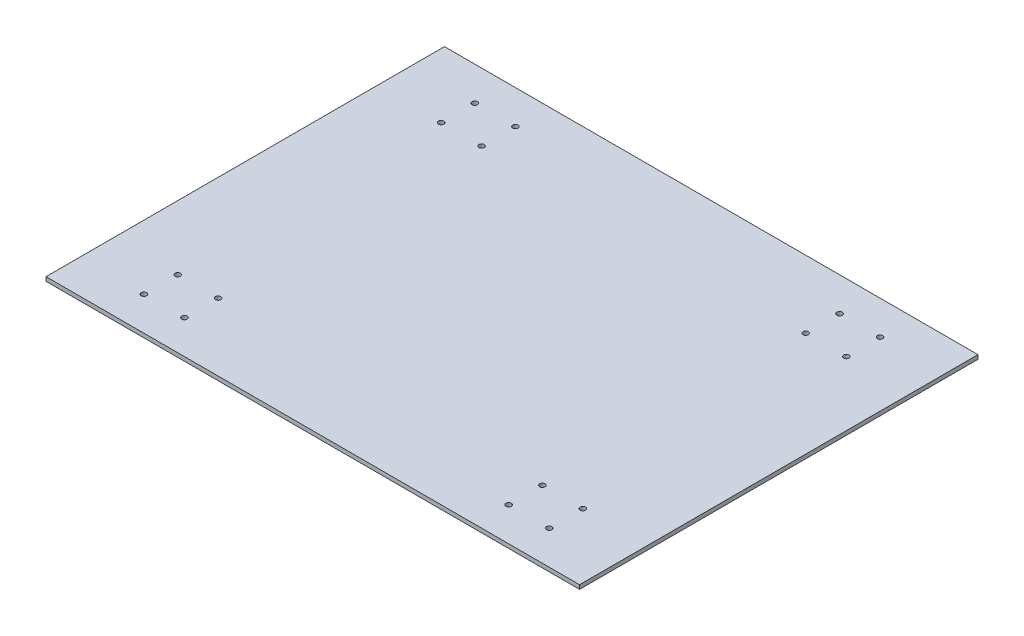
ISO-10303-21;
HEADER;
FILE_DESCRIPTION(('STEP AP214'),'2;1');
FILE_NAME('part.step','',(''),(''),'','','');
FILE_SCHEMA(('AUTOMOTIVE_DESIGN { 1 0 10303 214 1 1 1 1 }'));
ENDSEC;
DATA;
#1=APPLICATION_CONTEXT('core data for automotive mechanical design processes');
#2=APPLICATION_PROTOCOL_DEFINITION('international standard','automotive_design',2000,#1);
#3=PRODUCT_CONTEXT('',#1,'mechanical');
#4=PRODUCT('Part','Part','',(#3));
#5=PRODUCT_RELATED_PRODUCT_CATEGORY('part','',(#4));
#6=PRODUCT_DEFINITION_FORMATION('','',#4);
#7=PRODUCT_DEFINITION_CONTEXT('part definition',#1,'design');
#8=PRODUCT_DEFINITION('design','',#6,#7);
#9=PRODUCT_DEFINITION_SHAPE('','',#8);
#10=(LENGTH_UNIT() NAMED_UNIT(*) SI_UNIT(.MILLI.,.METRE.));
#11=(NAMED_UNIT(*) PLANE_ANGLE_UNIT() SI_UNIT($,.RADIAN.));
#12=(NAMED_UNIT(*) SI_UNIT($,.STERADIAN.) SOLID_ANGLE_UNIT());
#13=UNCERTAINTY_MEASURE_WITH_UNIT(LENGTH_MEASURE(1.E-05),#10,'distance_accuracy_value','');
#14=(GEOMETRIC_REPRESENTATION_CONTEXT(3) GLOBAL_UNCERTAINTY_ASSIGNED_CONTEXT((#13)) GLOBAL_UNIT_ASSIGNED_CONTEXT((#10,
#11,#12)) REPRESENTATION_CONTEXT('',''));
#15=CARTESIAN_POINT('',(0.,0.,0.));
#16=DIRECTION('',(0.,0.,1.));
#17=DIRECTION('',(1.,0.,0.));
#18=AXIS2_PLACEMENT_3D('',#15,#16,#17);
#19=CARTESIAN_POINT('',(197.5,3.,-147.5));
#20=DIRECTION('',(-1.,0.,0.));
#21=DIRECTION('',(0.,0.,1.));
#22=AXIS2_PLACEMENT_3D('',#19,#20,#21);
#23=PLANE('',#22);
#24=DIRECTION('',(0.,0.,-1.));
#25=VECTOR('',#24,1.);
#26=CARTESIAN_POINT('',(197.5,0.,-147.5));
#27=LINE('',#26,#25);
#28=CARTESIAN_POINT('',(197.5,0.,147.5));
#29=VERTEX_POINT('',#28);
#30=CARTESIAN_POINT('',(197.5,0.,-147.5));
#31=VERTEX_POINT('',#30);
#32=EDGE_CURVE('E97',#29,#31,#27,.T.);
#33=ORIENTED_EDGE('',*,*,#32,.T.);
#34=DIRECTION('',(0.,-1.,0.));
#35=VECTOR('',#34,1.);
#36=CARTESIAN_POINT('',(197.5,3.,-147.5));
#37=LINE('',#36,#35);
#38=CARTESIAN_POINT('',(197.5,3.,-147.5));
#39=VERTEX_POINT('',#38);
#40=EDGE_CURVE('E11',#39,#31,#37,.T.);
#41=ORIENTED_EDGE('',*,*,#40,.F.);
#42=DIRECTION('',(0.,0.,-1.));
#43=VECTOR('',#42,1.);
#44=CARTESIAN_POINT('',(197.5,3.,-147.5));
#45=LINE('',#44,#43);
#46=CARTESIAN_POINT('',(197.5,3.,147.5));
#47=VERTEX_POINT('',#46);
#48=EDGE_CURVE('E85',#47,#39,#45,.T.);
#49=ORIENTED_EDGE('',*,*,#48,.F.);
#50=DIRECTION('',(0.,-1.,0.));
#51=VECTOR('',#50,1.);
#52=CARTESIAN_POINT('',(197.5,3.,147.5));
#53=LINE('',#52,#51);
#54=EDGE_CURVE('E93',#47,#29,#53,.T.);
#55=ORIENTED_EDGE('',*,*,#54,.T.);
#56=EDGE_LOOP('',(#33,#41,#49,#55));
#57=FACE_BOUND('',#56,.T.);
#58=ADVANCED_FACE('F34',(#57),#23,.F.);
#59=CARTESIAN_POINT('',(-197.5,3.,-147.5));
#60=DIRECTION('',(0.,0.,1.));
#61=DIRECTION('',(1.,0.,0.));
#62=AXIS2_PLACEMENT_3D('',#59,#60,#61);
#63=PLANE('',#62);
#64=DIRECTION('',(-1.,0.,0.));
#65=VECTOR('',#64,1.);
#66=CARTESIAN_POINT('',(-197.5,0.,-147.5));
#67=LINE('',#66,#65);
#68=CARTESIAN_POINT('',(-197.5,0.,-147.5));
#69=VERTEX_POINT('',#68);
#70=EDGE_CURVE('E89',#31,#69,#67,.T.);
#71=ORIENTED_EDGE('',*,*,#70,.T.);
#72=DIRECTION('',(0.,-1.,0.));
#73=VECTOR('',#72,1.);
#74=CARTESIAN_POINT('',(-197.5,3.,-147.5));
#75=LINE('',#74,#73);
#76=CARTESIAN_POINT('',(-197.5,3.,-147.5));
#77=VERTEX_POINT('',#76);
#78=EDGE_CURVE('E42',#77,#69,#75,.T.);
#79=ORIENTED_EDGE('',*,*,#78,.F.);
#80=DIRECTION('',(-1.,0.,0.));
#81=VECTOR('',#80,1.);
#82=CARTESIAN_POINT('',(-197.5,3.,-147.5));
#83=LINE('',#82,#81);
#84=EDGE_CURVE('E80',#39,#77,#83,.T.);
#85=ORIENTED_EDGE('',*,*,#84,.F.);
#86=ORIENTED_EDGE('',*,*,#40,.T.);
#87=EDGE_LOOP('',(#71,#79,#85,#86));
#88=FACE_BOUND('',#87,.T.);
#89=ADVANCED_FACE('F88',(#88),#63,.F.);
#90=CARTESIAN_POINT('',(-197.5,3.,-147.5));
#91=DIRECTION('',(1.,0.,0.));
#92=DIRECTION('',(0.,0.,-1.));
#93=AXIS2_PLACEMENT_3D('',#90,#91,#92);
#94=PLANE('',#93);
#95=DIRECTION('',(0.,0.,1.));
#96=VECTOR('',#95,1.);
#97=CARTESIAN_POINT('',(-197.5,0.,-147.5));
#98=LINE('',#97,#96);
#99=CARTESIAN_POINT('',(-197.5,0.,147.5));
#100=VERTEX_POINT('',#99);
#101=EDGE_CURVE('E67',#69,#100,#98,.T.);
#102=ORIENTED_EDGE('',*,*,#101,.T.);
#103=DIRECTION('',(0.,-1.,0.));
#104=VECTOR('',#103,1.);
#105=CARTESIAN_POINT('',(-197.5,3.,147.5));
#106=LINE('',#105,#104);
#107=CARTESIAN_POINT('',(-197.5,3.,147.5));
#108=VERTEX_POINT('',#107);
#109=EDGE_CURVE('E90',#108,#100,#106,.T.);
#110=ORIENTED_EDGE('',*,*,#109,.F.);
#111=DIRECTION('',(0.,0.,1.));
#112=VECTOR('',#111,1.);
#113=CARTESIAN_POINT('',(-197.5,3.,-147.5));
#114=LINE('',#113,#112);
#115=EDGE_CURVE('E83',#77,#108,#114,.T.);
#116=ORIENTED_EDGE('',*,*,#115,.F.);
#117=ORIENTED_EDGE('',*,*,#78,.T.);
#118=EDGE_LOOP('',(#102,#110,#116,#117));
#119=FACE_BOUND('',#118,.T.);
#120=ADVANCED_FACE('F91',(#119),#94,.F.);
#121=CARTESIAN_POINT('',(-197.5,3.,147.5));
#122=DIRECTION('',(0.,0.,-1.));
#123=DIRECTION('',(-1.,0.,0.));
#124=AXIS2_PLACEMENT_3D('',#121,#122,#123);
#125=PLANE('',#124);
#126=DIRECTION('',(1.,0.,0.));
#127=VECTOR('',#126,1.);
#128=CARTESIAN_POINT('',(-197.5,0.,147.5));
#129=LINE('',#128,#127);
#130=EDGE_CURVE('E73',#100,#29,#129,.T.);
#131=ORIENTED_EDGE('',*,*,#130,.T.);
#132=ORIENTED_EDGE('',*,*,#54,.F.);
#133=DIRECTION('',(1.,0.,0.));
#134=VECTOR('',#133,1.);
#135=CARTESIAN_POINT('',(-197.5,3.,147.5));
#136=LINE('',#135,#134);
#137=EDGE_CURVE('E50',#108,#47,#136,.T.);
#138=ORIENTED_EDGE('',*,*,#137,.F.);
#139=ORIENTED_EDGE('',*,*,#109,.T.);
#140=EDGE_LOOP('',(#131,#132,#138,#139));
#141=FACE_BOUND('',#140,.T.);
#142=ADVANCED_FACE('F105',(#141),#125,.F.);
#143=CARTESIAN_POINT('',(0.,3.,0.));
#144=DIRECTION('',(0.,1.,0.));
#145=DIRECTION('',(0.,0.,1.));
#146=AXIS2_PLACEMENT_3D('',#143,#144,#145);
#147=PLANE('',#146);
#148=CARTESIAN_POINT('',(120.,3.,-97.5));
#149=DIRECTION('',(0.,1.,0.));
#150=DIRECTION('',(0.,0.,1.));
#151=AXIS2_PLACEMENT_3D('',#148,#149,#150);
#152=CIRCLE('',#151,2.);
#153=CARTESIAN_POINT('',(120.,3.,-95.5));
#154=VERTEX_POINT('',#153);
#155=EDGE_CURVE('E148',#154,#154,#152,.T.);
#156=ORIENTED_EDGE('',*,*,#155,.F.);
#157=EDGE_LOOP('',(#156));
#158=FACE_BOUND('',#157,.T.);
#159=CARTESIAN_POINT('',(150.,3.,-122.5));
#160=DIRECTION('',(0.,1.,0.));
#161=DIRECTION('',(0.,0.,1.));
#162=AXIS2_PLACEMENT_3D('',#159,#160,#161);
#163=CIRCLE('',#162,2.);
#164=CARTESIAN_POINT('',(150.,3.,-120.5));
#165=VERTEX_POINT('',#164);
#166=EDGE_CURVE('E141',#165,#165,#163,.T.);
#167=ORIENTED_EDGE('',*,*,#166,.F.);
#168=EDGE_LOOP('',(#167));
#169=FACE_BOUND('',#168,.T.);
#170=CARTESIAN_POINT('',(120.,3.,-122.5));
#171=DIRECTION('',(0.,1.,0.));
#172=DIRECTION('',(0.,0.,1.));
#173=AXIS2_PLACEMENT_3D('',#170,#171,#172);
#174=CIRCLE('',#173,1.99999999999998);
#175=CARTESIAN_POINT('',(120.,3.,-120.5));
#176=VERTEX_POINT('',#175);
#177=EDGE_CURVE('E160',#176,#176,#174,.T.);
#178=ORIENTED_EDGE('',*,*,#177,.F.);
#179=EDGE_LOOP('',(#178));
#180=FACE_BOUND('',#179,.T.);
#181=CARTESIAN_POINT('',(-120.,3.,122.5));
#182=DIRECTION('',(0.,1.,0.));
#183=DIRECTION('',(0.,0.,1.));
#184=AXIS2_PLACEMENT_3D('',#181,#182,#183);
#185=CIRCLE('',#184,2.);
#186=CARTESIAN_POINT('',(-120.,3.,124.5));
#187=VERTEX_POINT('',#186);
#188=EDGE_CURVE('E153',#187,#187,#185,.T.);
#189=ORIENTED_EDGE('',*,*,#188,.F.);
#190=EDGE_LOOP('',(#189));
#191=FACE_BOUND('',#190,.T.);
#192=CARTESIAN_POINT('',(120.,3.,122.5));
#193=DIRECTION('',(0.,1.,0.));
#194=DIRECTION('',(0.,0.,1.));
#195=AXIS2_PLACEMENT_3D('',#192,#193,#194);
#196=CIRCLE('',#195,2.);
#197=CARTESIAN_POINT('',(120.,3.,124.5));
#198=VERTEX_POINT('',#197);
#199=EDGE_CURVE('E124',#198,#198,#196,.T.);
#200=ORIENTED_EDGE('',*,*,#199,.F.);
#201=EDGE_LOOP('',(#200));
#202=FACE_BOUND('',#201,.T.);
#203=CARTESIAN_POINT('',(150.,3.,97.5));
#204=DIRECTION('',(0.,1.,0.));
#205=DIRECTION('',(0.,0.,1.));
#206=AXIS2_PLACEMENT_3D('',#203,#204,#205);
#207=CIRCLE('',#206,2.);
#208=CARTESIAN_POINT('',(150.,3.,99.5));
#209=VERTEX_POINT('',#208);
#210=EDGE_CURVE('E117',#209,#209,#207,.T.);
#211=ORIENTED_EDGE('',*,*,#210,.F.);
#212=EDGE_LOOP('',(#211));
#213=FACE_BOUND('',#212,.T.);
#214=CARTESIAN_POINT('',(120.,3.,97.5));
#215=DIRECTION('',(0.,1.,0.));
#216=DIRECTION('',(0.,0.,1.));
#217=AXIS2_PLACEMENT_3D('',#214,#215,#216);
#218=CIRCLE('',#217,2.);
#219=CARTESIAN_POINT('',(120.,3.,99.5));
#220=VERTEX_POINT('',#219);
#221=EDGE_CURVE('E136',#220,#220,#218,.T.);
#222=ORIENTED_EDGE('',*,*,#221,.F.);
#223=EDGE_LOOP('',(#222));
#224=FACE_BOUND('',#223,.T.);
#225=CARTESIAN_POINT('',(150.,3.,-97.5));
#226=DIRECTION('',(0.,1.,0.));
#227=DIRECTION('',(0.,0.,1.));
#228=AXIS2_PLACEMENT_3D('',#225,#226,#227);
#229=CIRCLE('',#228,2.);
#230=CARTESIAN_POINT('',(150.,3.,-95.5));
#231=VERTEX_POINT('',#230);
#232=EDGE_CURVE('E129',#231,#231,#229,.T.);
#233=ORIENTED_EDGE('',*,*,#232,.F.);
#234=EDGE_LOOP('',(#233));
#235=FACE_BOUND('',#234,.T.);
#236=CARTESIAN_POINT('',(-150.,3.,-97.5));
#237=DIRECTION('',(0.,1.,0.));
#238=DIRECTION('',(0.,0.,1.));
#239=AXIS2_PLACEMENT_3D('',#236,#237,#238);
#240=CIRCLE('',#239,2.);
#241=CARTESIAN_POINT('',(-150.,3.,-95.5));
#242=VERTEX_POINT('',#241);
#243=EDGE_CURVE('E196',#242,#242,#240,.T.);
#244=ORIENTED_EDGE('',*,*,#243,.F.);
#245=EDGE_LOOP('',(#244));
#246=FACE_BOUND('',#245,.T.);
#247=CARTESIAN_POINT('',(-120.,3.,-122.5));
#248=DIRECTION('',(0.,1.,0.));
#249=DIRECTION('',(0.,0.,1.));
#250=AXIS2_PLACEMENT_3D('',#247,#248,#249);
#251=CIRCLE('',#250,2.);
#252=CARTESIAN_POINT('',(-120.,3.,-120.5));
#253=VERTEX_POINT('',#252);
#254=EDGE_CURVE('E189',#253,#253,#251,.T.);
#255=ORIENTED_EDGE('',*,*,#254,.F.);
#256=EDGE_LOOP('',(#255));
#257=FACE_BOUND('',#256,.T.);
#258=CARTESIAN_POINT('',(-150.,3.,-122.5));
#259=DIRECTION('',(0.,1.,0.));
#260=DIRECTION('',(0.,0.,1.));
#261=AXIS2_PLACEMENT_3D('',#258,#259,#260);
#262=CIRCLE('',#261,2.);
#263=CARTESIAN_POINT('',(-150.,3.,-120.5));
#264=VERTEX_POINT('',#263);
#265=EDGE_CURVE('E201',#264,#264,#262,.T.);
#266=ORIENTED_EDGE('',*,*,#265,.F.);
#267=EDGE_LOOP('',(#266));
#268=FACE_BOUND('',#267,.T.);
#269=CARTESIAN_POINT('',(-150.,3.,122.5));
#270=DIRECTION('',(0.,1.,0.));
#271=DIRECTION('',(0.,0.,1.));
#272=AXIS2_PLACEMENT_3D('',#269,#270,#271);
#273=CIRCLE('',#272,2.);
#274=CARTESIAN_POINT('',(-150.,3.,124.5));
#275=VERTEX_POINT('',#274);
#276=EDGE_CURVE('E172',#275,#275,#273,.T.);
#277=ORIENTED_EDGE('',*,*,#276,.F.);
#278=EDGE_LOOP('',(#277));
#279=FACE_BOUND('',#278,.T.);
#280=CARTESIAN_POINT('',(-120.,3.,97.5));
#281=DIRECTION('',(0.,1.,0.));
#282=DIRECTION('',(0.,0.,1.));
#283=AXIS2_PLACEMENT_3D('',#280,#281,#282);
#284=CIRCLE('',#283,2.);
#285=CARTESIAN_POINT('',(-120.,3.,99.5));
#286=VERTEX_POINT('',#285);
#287=EDGE_CURVE('E165',#286,#286,#284,.T.);
#288=ORIENTED_EDGE('',*,*,#287,.F.);
#289=EDGE_LOOP('',(#288));
#290=FACE_BOUND('',#289,.T.);
#291=CARTESIAN_POINT('',(-150.,3.,97.5));
#292=DIRECTION('',(0.,1.,0.));
#293=DIRECTION('',(0.,0.,1.));
#294=AXIS2_PLACEMENT_3D('',#291,#292,#293);
#295=CIRCLE('',#294,2.);
#296=CARTESIAN_POINT('',(-150.,3.,99.5));
#297=VERTEX_POINT('',#296);
#298=EDGE_CURVE('E184',#297,#297,#295,.T.);
#299=ORIENTED_EDGE('',*,*,#298,.F.);
#300=EDGE_LOOP('',(#299));
#301=FACE_BOUND('',#300,.T.);
#302=CARTESIAN_POINT('',(-120.,3.,-97.5));
#303=DIRECTION('',(0.,1.,0.));
#304=DIRECTION('',(0.,0.,1.));
#305=AXIS2_PLACEMENT_3D('',#302,#303,#304);
#306=CIRCLE('',#305,2.);
#307=CARTESIAN_POINT('',(-120.,3.,-95.5));
#308=VERTEX_POINT('',#307);
#309=EDGE_CURVE('E177',#308,#308,#306,.T.);
#310=ORIENTED_EDGE('',*,*,#309,.F.);
#311=EDGE_LOOP('',(#310));
#312=FACE_BOUND('',#311,.T.);
#313=CARTESIAN_POINT('',(150.,3.,122.5));
#314=DIRECTION('',(0.,1.,0.));
#315=DIRECTION('',(0.,0.,1.));
#316=AXIS2_PLACEMENT_3D('',#313,#314,#315);
#317=CIRCLE('',#316,2.);
#318=CARTESIAN_POINT('',(150.,3.,124.5));
#319=VERTEX_POINT('',#318);
#320=EDGE_CURVE('E111',#319,#319,#317,.T.);
#321=ORIENTED_EDGE('',*,*,#320,.F.);
#322=EDGE_LOOP('',(#321));
#323=FACE_BOUND('',#322,.T.);
#324=ORIENTED_EDGE('',*,*,#48,.T.);
#325=ORIENTED_EDGE('',*,*,#84,.T.);
#326=ORIENTED_EDGE('',*,*,#115,.T.);
#327=ORIENTED_EDGE('',*,*,#137,.T.);
#328=EDGE_LOOP('',(#324,#325,#326,#327));
#329=FACE_BOUND('',#328,.T.);
#330=ADVANCED_FACE('F81',(#158,#169,#180,#191,#202,#213,#224,#235,#246,#257,#268,#279,#290,#301,
#312,#323,#329),#147,.T.);
#331=CARTESIAN_POINT('',(0.,0.,0.));
#332=DIRECTION('',(0.,1.,0.));
#333=DIRECTION('',(0.,0.,1.));
#334=AXIS2_PLACEMENT_3D('',#331,#332,#333);
#335=PLANE('',#334);
#336=CARTESIAN_POINT('',(120.,0.,-97.5));
#337=DIRECTION('',(0.,1.,0.));
#338=DIRECTION('',(0.,0.,1.));
#339=AXIS2_PLACEMENT_3D('',#336,#337,#338);
#340=CIRCLE('',#339,2.);
#341=CARTESIAN_POINT('',(120.,0.,-95.5));
#342=VERTEX_POINT('',#341);
#343=EDGE_CURVE('E133',#342,#342,#340,.T.);
#344=ORIENTED_EDGE('',*,*,#343,.T.);
#345=EDGE_LOOP('',(#344));
#346=FACE_BOUND('',#345,.T.);
#347=CARTESIAN_POINT('',(150.,0.,-122.5));
#348=DIRECTION('',(0.,1.,0.));
#349=DIRECTION('',(0.,0.,1.));
#350=AXIS2_PLACEMENT_3D('',#347,#348,#349);
#351=CIRCLE('',#350,2.);
#352=CARTESIAN_POINT('',(150.,0.,-120.5));
#353=VERTEX_POINT('',#352);
#354=EDGE_CURVE('E144',#353,#353,#351,.T.);
#355=ORIENTED_EDGE('',*,*,#354,.T.);
#356=EDGE_LOOP('',(#355));
#357=FACE_BOUND('',#356,.T.);
#358=CARTESIAN_POINT('',(120.,0.,-122.5));
#359=DIRECTION('',(0.,1.,0.));
#360=DIRECTION('',(0.,0.,1.));
#361=AXIS2_PLACEMENT_3D('',#358,#359,#360);
#362=CIRCLE('',#361,1.99999999999998);
#363=CARTESIAN_POINT('',(120.,0.,-120.5));
#364=VERTEX_POINT('',#363);
#365=EDGE_CURVE('E145',#364,#364,#362,.T.);
#366=ORIENTED_EDGE('',*,*,#365,.T.);
#367=EDGE_LOOP('',(#366));
#368=FACE_BOUND('',#367,.T.);
#369=CARTESIAN_POINT('',(-120.,0.,122.5));
#370=DIRECTION('',(0.,1.,0.));
#371=DIRECTION('',(0.,0.,1.));
#372=AXIS2_PLACEMENT_3D('',#369,#370,#371);
#373=CIRCLE('',#372,2.);
#374=CARTESIAN_POINT('',(-120.,0.,124.5));
#375=VERTEX_POINT('',#374);
#376=EDGE_CURVE('E156',#375,#375,#373,.T.);
#377=ORIENTED_EDGE('',*,*,#376,.T.);
#378=EDGE_LOOP('',(#377));
#379=FACE_BOUND('',#378,.T.);
#380=CARTESIAN_POINT('',(120.,0.,122.5));
#381=DIRECTION('',(0.,1.,0.));
#382=DIRECTION('',(0.,0.,1.));
#383=AXIS2_PLACEMENT_3D('',#380,#381,#382);
#384=CIRCLE('',#383,2.);
#385=CARTESIAN_POINT('',(120.,0.,124.5));
#386=VERTEX_POINT('',#385);
#387=EDGE_CURVE('E114',#386,#386,#384,.T.);
#388=ORIENTED_EDGE('',*,*,#387,.T.);
#389=EDGE_LOOP('',(#388));
#390=FACE_BOUND('',#389,.T.);
#391=CARTESIAN_POINT('',(150.,0.,97.5));
#392=DIRECTION('',(0.,1.,0.));
#393=DIRECTION('',(0.,0.,1.));
#394=AXIS2_PLACEMENT_3D('',#391,#392,#393);
#395=CIRCLE('',#394,2.);
#396=CARTESIAN_POINT('',(150.,0.,99.5));
#397=VERTEX_POINT('',#396);
#398=EDGE_CURVE('E120',#397,#397,#395,.T.);
#399=ORIENTED_EDGE('',*,*,#398,.T.);
#400=EDGE_LOOP('',(#399));
#401=FACE_BOUND('',#400,.T.);
#402=CARTESIAN_POINT('',(120.,0.,97.5));
#403=DIRECTION('',(0.,1.,0.));
#404=DIRECTION('',(0.,0.,1.));
#405=AXIS2_PLACEMENT_3D('',#402,#403,#404);
#406=CIRCLE('',#405,2.);
#407=CARTESIAN_POINT('',(120.,0.,99.5));
#408=VERTEX_POINT('',#407);
#409=EDGE_CURVE('E121',#408,#408,#406,.T.);
#410=ORIENTED_EDGE('',*,*,#409,.T.);
#411=EDGE_LOOP('',(#410));
#412=FACE_BOUND('',#411,.T.);
#413=CARTESIAN_POINT('',(150.,0.,-97.5));
#414=DIRECTION('',(0.,1.,0.));
#415=DIRECTION('',(0.,0.,1.));
#416=AXIS2_PLACEMENT_3D('',#413,#414,#415);
#417=CIRCLE('',#416,2.);
#418=CARTESIAN_POINT('',(150.,0.,-95.5));
#419=VERTEX_POINT('',#418);
#420=EDGE_CURVE('E132',#419,#419,#417,.T.);
#421=ORIENTED_EDGE('',*,*,#420,.T.);
#422=EDGE_LOOP('',(#421));
#423=FACE_BOUND('',#422,.T.);
#424=CARTESIAN_POINT('',(-150.,0.,-97.5));
#425=DIRECTION('',(0.,1.,0.));
#426=DIRECTION('',(0.,0.,1.));
#427=AXIS2_PLACEMENT_3D('',#424,#425,#426);
#428=CIRCLE('',#427,2.);
#429=CARTESIAN_POINT('',(-150.,0.,-95.5));
#430=VERTEX_POINT('',#429);
#431=EDGE_CURVE('E181',#430,#430,#428,.T.);
#432=ORIENTED_EDGE('',*,*,#431,.T.);
#433=EDGE_LOOP('',(#432));
#434=FACE_BOUND('',#433,.T.);
#435=CARTESIAN_POINT('',(-120.,0.,-122.5));
#436=DIRECTION('',(0.,1.,0.));
#437=DIRECTION('',(0.,0.,1.));
#438=AXIS2_PLACEMENT_3D('',#435,#436,#437);
#439=CIRCLE('',#438,2.);
#440=CARTESIAN_POINT('',(-120.,0.,-120.5));
#441=VERTEX_POINT('',#440);
#442=EDGE_CURVE('E192',#441,#441,#439,.T.);
#443=ORIENTED_EDGE('',*,*,#442,.T.);
#444=EDGE_LOOP('',(#443));
#445=FACE_BOUND('',#444,.T.);
#446=CARTESIAN_POINT('',(-150.,0.,-122.5));
#447=DIRECTION('',(0.,1.,0.));
#448=DIRECTION('',(0.,0.,1.));
#449=AXIS2_PLACEMENT_3D('',#446,#447,#448);
#450=CIRCLE('',#449,2.);
#451=CARTESIAN_POINT('',(-150.,0.,-120.5));
#452=VERTEX_POINT('',#451);
#453=EDGE_CURVE('E193',#452,#452,#450,.T.);
#454=ORIENTED_EDGE('',*,*,#453,.T.);
#455=EDGE_LOOP('',(#454));
#456=FACE_BOUND('',#455,.T.);
#457=CARTESIAN_POINT('',(-150.,0.,122.5));
#458=DIRECTION('',(0.,1.,0.));
#459=DIRECTION('',(0.,0.,1.));
#460=AXIS2_PLACEMENT_3D('',#457,#458,#459);
#461=CIRCLE('',#460,2.);
#462=CARTESIAN_POINT('',(-150.,0.,124.5));
#463=VERTEX_POINT('',#462);
#464=EDGE_CURVE('E157',#463,#463,#461,.T.);
#465=ORIENTED_EDGE('',*,*,#464,.T.);
#466=EDGE_LOOP('',(#465));
#467=FACE_BOUND('',#466,.T.);
#468=CARTESIAN_POINT('',(-120.,0.,97.5));
#469=DIRECTION('',(0.,1.,0.));
#470=DIRECTION('',(0.,0.,1.));
#471=AXIS2_PLACEMENT_3D('',#468,#469,#470);
#472=CIRCLE('',#471,2.);
#473=CARTESIAN_POINT('',(-120.,0.,99.5));
#474=VERTEX_POINT('',#473);
#475=EDGE_CURVE('E168',#474,#474,#472,.T.);
#476=ORIENTED_EDGE('',*,*,#475,.T.);
#477=EDGE_LOOP('',(#476));
#478=FACE_BOUND('',#477,.T.);
#479=CARTESIAN_POINT('',(-150.,0.,97.5));
#480=DIRECTION('',(0.,1.,0.));
#481=DIRECTION('',(0.,0.,1.));
#482=AXIS2_PLACEMENT_3D('',#479,#480,#481);
#483=CIRCLE('',#482,2.);
#484=CARTESIAN_POINT('',(-150.,0.,99.5));
#485=VERTEX_POINT('',#484);
#486=EDGE_CURVE('E169',#485,#485,#483,.T.);
#487=ORIENTED_EDGE('',*,*,#486,.T.);
#488=EDGE_LOOP('',(#487));
#489=FACE_BOUND('',#488,.T.);
#490=CARTESIAN_POINT('',(-120.,0.,-97.5));
#491=DIRECTION('',(0.,1.,0.));
#492=DIRECTION('',(0.,0.,1.));
#493=AXIS2_PLACEMENT_3D('',#490,#491,#492);
#494=CIRCLE('',#493,2.);
#495=CARTESIAN_POINT('',(-120.,0.,-95.5));
#496=VERTEX_POINT('',#495);
#497=EDGE_CURVE('E180',#496,#496,#494,.T.);
#498=ORIENTED_EDGE('',*,*,#497,.T.);
#499=EDGE_LOOP('',(#498));
#500=FACE_BOUND('',#499,.T.);
#501=CARTESIAN_POINT('',(150.,0.,122.5));
#502=DIRECTION('',(0.,1.,0.));
#503=DIRECTION('',(0.,0.,1.));
#504=AXIS2_PLACEMENT_3D('',#501,#502,#503);
#505=CIRCLE('',#504,2.);
#506=CARTESIAN_POINT('',(150.,0.,124.5));
#507=VERTEX_POINT('',#506);
#508=EDGE_CURVE('E100',#507,#507,#505,.T.);
#509=ORIENTED_EDGE('',*,*,#508,.T.);
#510=EDGE_LOOP('',(#509));
#511=FACE_BOUND('',#510,.T.);
#512=ORIENTED_EDGE('',*,*,#32,.F.);
#513=ORIENTED_EDGE('',*,*,#130,.F.);
#514=ORIENTED_EDGE('',*,*,#101,.F.);
#515=ORIENTED_EDGE('',*,*,#70,.F.);
#516=EDGE_LOOP('',(#512,#513,#514,#515));
#517=FACE_BOUND('',#516,.T.);
#518=ADVANCED_FACE('F108',(#346,#357,#368,#379,#390,#401,#412,#423,#434,#445,#456,#467,#478,
#489,#500,#511,#517),#335,.F.);
#519=CARTESIAN_POINT('',(150.,0.,122.5));
#520=DIRECTION('',(0.,1.,0.));
#521=DIRECTION('',(0.,0.,1.));
#522=AXIS2_PLACEMENT_3D('',#519,#520,#521);
#523=CYLINDRICAL_SURFACE('',#522,2.);
#524=ORIENTED_EDGE('',*,*,#508,.F.);
#525=EDGE_LOOP('',(#524));
#526=FACE_BOUND('',#525,.T.);
#527=ORIENTED_EDGE('',*,*,#320,.T.);
#528=EDGE_LOOP('',(#527));
#529=FACE_BOUND('',#528,.T.);
#530=ADVANCED_FACE('F231',(#526,#529),#523,.F.);
#531=CARTESIAN_POINT('',(-120.,0.,-97.5));
#532=DIRECTION('',(0.,1.,0.));
#533=DIRECTION('',(0.,0.,1.));
#534=AXIS2_PLACEMENT_3D('',#531,#532,#533);
#535=CYLINDRICAL_SURFACE('',#534,2.);
#536=ORIENTED_EDGE('',*,*,#497,.F.);
#537=EDGE_LOOP('',(#536));
#538=FACE_BOUND('',#537,.T.);
#539=ORIENTED_EDGE('',*,*,#309,.T.);
#540=EDGE_LOOP('',(#539));
#541=FACE_BOUND('',#540,.T.);
#542=ADVANCED_FACE('F233',(#538,#541),#535,.F.);
#543=CARTESIAN_POINT('',(-150.,0.,97.5));
#544=DIRECTION('',(0.,1.,0.));
#545=DIRECTION('',(0.,0.,1.));
#546=AXIS2_PLACEMENT_3D('',#543,#544,#545);
#547=CYLINDRICAL_SURFACE('',#546,2.);
#548=ORIENTED_EDGE('',*,*,#486,.F.);
#549=EDGE_LOOP('',(#548));
#550=FACE_BOUND('',#549,.T.);
#551=ORIENTED_EDGE('',*,*,#298,.T.);
#552=EDGE_LOOP('',(#551));
#553=FACE_BOUND('',#552,.T.);
#554=ADVANCED_FACE('F240',(#550,#553),#547,.F.);
#555=CARTESIAN_POINT('',(-120.,0.,97.5));
#556=DIRECTION('',(0.,1.,0.));
#557=DIRECTION('',(0.,0.,1.));
#558=AXIS2_PLACEMENT_3D('',#555,#556,#557);
#559=CYLINDRICAL_SURFACE('',#558,2.);
#560=ORIENTED_EDGE('',*,*,#475,.F.);
#561=EDGE_LOOP('',(#560));
#562=FACE_BOUND('',#561,.T.);
#563=ORIENTED_EDGE('',*,*,#287,.T.);
#564=EDGE_LOOP('',(#563));
#565=FACE_BOUND('',#564,.T.);
#566=ADVANCED_FACE('F290',(#562,#565),#559,.F.);
#567=CARTESIAN_POINT('',(-150.,0.,122.5));
#568=DIRECTION('',(0.,1.,0.));
#569=DIRECTION('',(0.,0.,1.));
#570=AXIS2_PLACEMENT_3D('',#567,#568,#569);
#571=CYLINDRICAL_SURFACE('',#570,2.);
#572=ORIENTED_EDGE('',*,*,#464,.F.);
#573=EDGE_LOOP('',(#572));
#574=FACE_BOUND('',#573,.T.);
#575=ORIENTED_EDGE('',*,*,#276,.T.);
#576=EDGE_LOOP('',(#575));
#577=FACE_BOUND('',#576,.T.);
#578=ADVANCED_FACE('F213',(#574,#577),#571,.F.);
#579=CARTESIAN_POINT('',(-150.,0.,-122.5));
#580=DIRECTION('',(0.,1.,0.));
#581=DIRECTION('',(0.,0.,1.));
#582=AXIS2_PLACEMENT_3D('',#579,#580,#581);
#583=CYLINDRICAL_SURFACE('',#582,2.);
#584=ORIENTED_EDGE('',*,*,#453,.F.);
#585=EDGE_LOOP('',(#584));
#586=FACE_BOUND('',#585,.T.);
#587=ORIENTED_EDGE('',*,*,#265,.T.);
#588=EDGE_LOOP('',(#587));
#589=FACE_BOUND('',#588,.T.);
#590=ADVANCED_FACE('F209',(#586,#589),#583,.F.);
#591=CARTESIAN_POINT('',(-120.,0.,-122.5));
#592=DIRECTION('',(0.,1.,0.));
#593=DIRECTION('',(0.,0.,1.));
#594=AXIS2_PLACEMENT_3D('',#591,#592,#593);
#595=CYLINDRICAL_SURFACE('',#594,2.);
#596=ORIENTED_EDGE('',*,*,#442,.F.);
#597=EDGE_LOOP('',(#596));
#598=FACE_BOUND('',#597,.T.);
#599=ORIENTED_EDGE('',*,*,#254,.T.);
#600=EDGE_LOOP('',(#599));
#601=FACE_BOUND('',#600,.T.);
#602=ADVANCED_FACE('F212',(#598,#601),#595,.F.);
#603=CARTESIAN_POINT('',(-150.,0.,-97.5));
#604=DIRECTION('',(0.,1.,0.));
#605=DIRECTION('',(0.,0.,1.));
#606=AXIS2_PLACEMENT_3D('',#603,#604,#605);
#607=CYLINDRICAL_SURFACE('',#606,2.);
#608=ORIENTED_EDGE('',*,*,#431,.F.);
#609=EDGE_LOOP('',(#608));
#610=FACE_BOUND('',#609,.T.);
#611=ORIENTED_EDGE('',*,*,#243,.T.);
#612=EDGE_LOOP('',(#611));
#613=FACE_BOUND('',#612,.T.);
#614=ADVANCED_FACE('F324',(#610,#613),#607,.F.);
#615=CARTESIAN_POINT('',(150.,0.,-97.5));
#616=DIRECTION('',(0.,1.,0.));
#617=DIRECTION('',(0.,0.,1.));
#618=AXIS2_PLACEMENT_3D('',#615,#616,#617);
#619=CYLINDRICAL_SURFACE('',#618,2.);
#620=ORIENTED_EDGE('',*,*,#420,.F.);
#621=EDGE_LOOP('',(#620));
#622=FACE_BOUND('',#621,.T.);
#623=ORIENTED_EDGE('',*,*,#232,.T.);
#624=EDGE_LOOP('',(#623));
#625=FACE_BOUND('',#624,.T.);
#626=ADVANCED_FACE('F334',(#622,#625),#619,.F.);
#627=CARTESIAN_POINT('',(120.,0.,97.5));
#628=DIRECTION('',(0.,1.,0.));
#629=DIRECTION('',(0.,0.,1.));
#630=AXIS2_PLACEMENT_3D('',#627,#628,#629);
#631=CYLINDRICAL_SURFACE('',#630,2.);
#632=ORIENTED_EDGE('',*,*,#409,.F.);
#633=EDGE_LOOP('',(#632));
#634=FACE_BOUND('',#633,.T.);
#635=ORIENTED_EDGE('',*,*,#221,.T.);
#636=EDGE_LOOP('',(#635));
#637=FACE_BOUND('',#636,.T.);
#638=ADVANCED_FACE('F344',(#634,#637),#631,.F.);
#639=CARTESIAN_POINT('',(150.,0.,97.5));
#640=DIRECTION('',(0.,1.,0.));
#641=DIRECTION('',(0.,0.,1.));
#642=AXIS2_PLACEMENT_3D('',#639,#640,#641);
#643=CYLINDRICAL_SURFACE('',#642,2.);
#644=ORIENTED_EDGE('',*,*,#398,.F.);
#645=EDGE_LOOP('',(#644));
#646=FACE_BOUND('',#645,.T.);
#647=ORIENTED_EDGE('',*,*,#210,.T.);
#648=EDGE_LOOP('',(#647));
#649=FACE_BOUND('',#648,.T.);
#650=ADVANCED_FACE('F354',(#646,#649),#643,.F.);
#651=CARTESIAN_POINT('',(120.,0.,122.5));
#652=DIRECTION('',(0.,1.,0.));
#653=DIRECTION('',(0.,0.,1.));
#654=AXIS2_PLACEMENT_3D('',#651,#652,#653);
#655=CYLINDRICAL_SURFACE('',#654,2.);
#656=ORIENTED_EDGE('',*,*,#387,.F.);
#657=EDGE_LOOP('',(#656));
#658=FACE_BOUND('',#657,.T.);
#659=ORIENTED_EDGE('',*,*,#199,.T.);
#660=EDGE_LOOP('',(#659));
#661=FACE_BOUND('',#660,.T.);
#662=ADVANCED_FACE('F364',(#658,#661),#655,.F.);
#663=CARTESIAN_POINT('',(-120.,0.,122.5));
#664=DIRECTION('',(0.,1.,0.));
#665=DIRECTION('',(0.,0.,1.));
#666=AXIS2_PLACEMENT_3D('',#663,#664,#665);
#667=CYLINDRICAL_SURFACE('',#666,2.);
#668=ORIENTED_EDGE('',*,*,#376,.F.);
#669=EDGE_LOOP('',(#668));
#670=FACE_BOUND('',#669,.T.);
#671=ORIENTED_EDGE('',*,*,#188,.T.);
#672=EDGE_LOOP('',(#671));
#673=FACE_BOUND('',#672,.T.);
#674=ADVANCED_FACE('F373',(#670,#673),#667,.F.);
#675=CARTESIAN_POINT('',(120.,0.,-122.5));
#676=DIRECTION('',(0.,1.,0.));
#677=DIRECTION('',(0.,0.,1.));
#678=AXIS2_PLACEMENT_3D('',#675,#676,#677);
#679=CYLINDRICAL_SURFACE('',#678,1.99999999999998);
#680=ORIENTED_EDGE('',*,*,#365,.F.);
#681=EDGE_LOOP('',(#680));
#682=FACE_BOUND('',#681,.T.);
#683=ORIENTED_EDGE('',*,*,#177,.T.);
#684=EDGE_LOOP('',(#683));
#685=FACE_BOUND('',#684,.T.);
#686=ADVANCED_FACE('F383',(#682,#685),#679,.F.);
#687=CARTESIAN_POINT('',(150.,0.,-122.5));
#688=DIRECTION('',(0.,1.,0.));
#689=DIRECTION('',(0.,0.,1.));
#690=AXIS2_PLACEMENT_3D('',#687,#688,#689);
#691=CYLINDRICAL_SURFACE('',#690,2.);
#692=ORIENTED_EDGE('',*,*,#354,.F.);
#693=EDGE_LOOP('',(#692));
#694=FACE_BOUND('',#693,.T.);
#695=ORIENTED_EDGE('',*,*,#166,.T.);
#696=EDGE_LOOP('',(#695));
#697=FACE_BOUND('',#696,.T.);
#698=ADVANCED_FACE('F393',(#694,#697),#691,.F.);
#699=CARTESIAN_POINT('',(120.,0.,-97.5));
#700=DIRECTION('',(0.,1.,0.));
#701=DIRECTION('',(0.,0.,1.));
#702=AXIS2_PLACEMENT_3D('',#699,#700,#701);
#703=CYLINDRICAL_SURFACE('',#702,2.);
#704=ORIENTED_EDGE('',*,*,#343,.F.);
#705=EDGE_LOOP('',(#704));
#706=FACE_BOUND('',#705,.T.);
#707=ORIENTED_EDGE('',*,*,#155,.T.);
#708=EDGE_LOOP('',(#707));
#709=FACE_BOUND('',#708,.T.);
#710=ADVANCED_FACE('F403',(#706,#709),#703,.F.);
#711=CLOSED_SHELL('',(#58,#89,#120,#142,#330,#518,#530,#542,#554,#566,#578,#590,#602,#614,#626,
#638,#650,#662,#674,#686,#698,#710));
#712=MANIFOLD_SOLID_BREP('B2',#711);
#713=ADVANCED_BREP_SHAPE_REPRESENTATION('',(#18,#712),#14);
#714=SHAPE_DEFINITION_REPRESENTATION(#9,#713);
ENDSEC;
END-ISO-10303-21;
